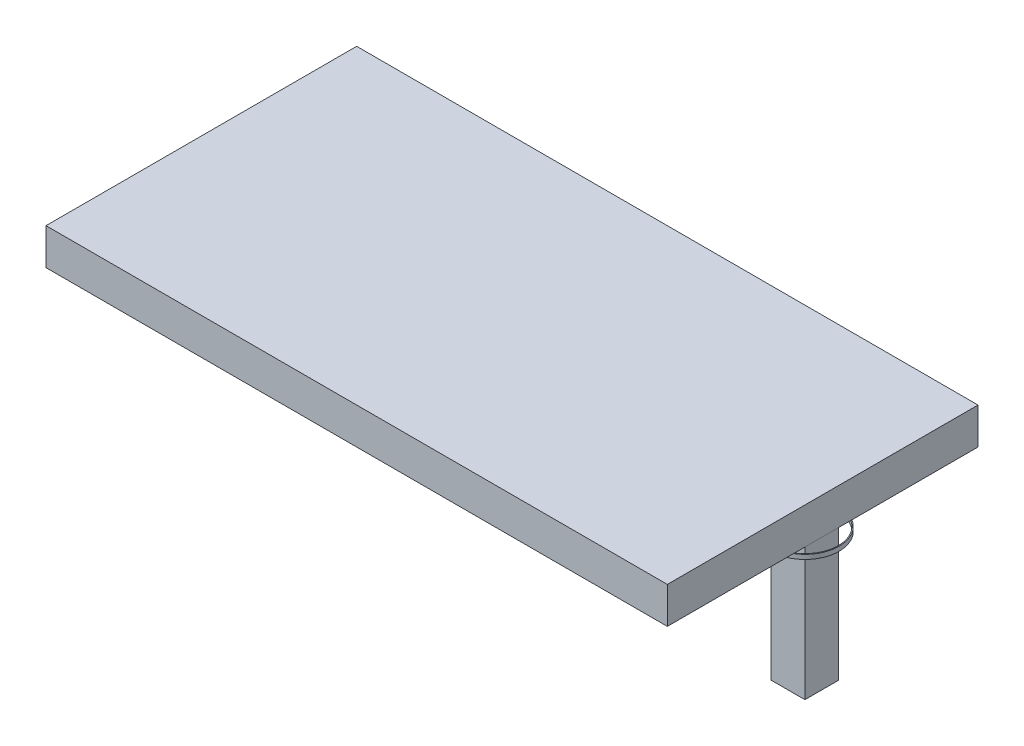
ISO-10303-21;
HEADER;
FILE_DESCRIPTION(('STEP AP214'),'2;1');
FILE_NAME('part.step','',(''),(''),'','','');
FILE_SCHEMA(('AUTOMOTIVE_DESIGN { 1 0 10303 214 1 1 1 1 }'));
ENDSEC;
DATA;
#1=APPLICATION_CONTEXT('core data for automotive mechanical design processes');
#2=APPLICATION_PROTOCOL_DEFINITION('international standard','automotive_design',2000,#1);
#3=PRODUCT_CONTEXT('',#1,'mechanical');
#4=PRODUCT('Part','Part','',(#3));
#5=PRODUCT_RELATED_PRODUCT_CATEGORY('part','',(#4));
#6=PRODUCT_DEFINITION_FORMATION('','',#4);
#7=PRODUCT_DEFINITION_CONTEXT('part definition',#1,'design');
#8=PRODUCT_DEFINITION('design','',#6,#7);
#9=PRODUCT_DEFINITION_SHAPE('','',#8);
#10=(LENGTH_UNIT() NAMED_UNIT(*) SI_UNIT(.MILLI.,.METRE.));
#11=(NAMED_UNIT(*) PLANE_ANGLE_UNIT() SI_UNIT($,.RADIAN.));
#12=(NAMED_UNIT(*) SI_UNIT($,.STERADIAN.) SOLID_ANGLE_UNIT());
#13=UNCERTAINTY_MEASURE_WITH_UNIT(LENGTH_MEASURE(1.E-05),#10,'distance_accuracy_value','');
#14=(GEOMETRIC_REPRESENTATION_CONTEXT(3) GLOBAL_UNCERTAINTY_ASSIGNED_CONTEXT((#13)) GLOBAL_UNIT_ASSIGNED_CONTEXT((#10,
#11,#12)) REPRESENTATION_CONTEXT('',''));
#15=CARTESIAN_POINT('',(0.,0.,0.));
#16=DIRECTION('',(0.,0.,1.));
#17=DIRECTION('',(1.,0.,0.));
#18=AXIS2_PLACEMENT_3D('',#15,#16,#17);
#19=CARTESIAN_POINT('',(0.,0.,0.));
#20=DIRECTION('',(0.,1.,0.));
#21=DIRECTION('',(0.,0.,1.));
#22=AXIS2_PLACEMENT_3D('',#19,#20,#21);
#23=PLANE('',#22);
#24=CARTESIAN_POINT('',(330.,0.,-1.11022302462516E-13));
#25=DIRECTION('',(0.,-1.,0.));
#26=DIRECTION('',(0.,0.,1.));
#27=AXIS2_PLACEMENT_3D('',#24,#25,#26);
#28=CIRCLE('',#27,38.5);
#29=CARTESIAN_POINT('',(310.,0.,-32.8975682991921));
#30=VERTEX_POINT('',#29);
#31=CARTESIAN_POINT('',(350.,0.,-32.897568299192));
#32=VERTEX_POINT('',#31);
#33=EDGE_CURVE('E244',#30,#32,#28,.T.);
#34=ORIENTED_EDGE('',*,*,#33,.F.);
#35=DIRECTION('',(0.,0.,-1.));
#36=VECTOR('',#35,1.);
#37=CARTESIAN_POINT('',(310.,0.,135.));
#38=LINE('',#37,#36);
#39=CARTESIAN_POINT('',(310.,0.,-135.));
#40=VERTEX_POINT('',#39);
#41=EDGE_CURVE('E230',#30,#40,#38,.T.);
#42=ORIENTED_EDGE('',*,*,#41,.T.);
#43=DIRECTION('',(-1.,0.,0.));
#44=VECTOR('',#43,1.);
#45=CARTESIAN_POINT('',(-310.,0.,-135.));
#46=LINE('',#45,#44);
#47=CARTESIAN_POINT('',(-310.,0.,-135.));
#48=VERTEX_POINT('',#47);
#49=EDGE_CURVE('E486',#40,#48,#46,.T.);
#50=ORIENTED_EDGE('',*,*,#49,.T.);
#51=DIRECTION('',(0.,0.,1.));
#52=VECTOR('',#51,1.);
#53=CARTESIAN_POINT('',(-310.,0.,135.));
#54=LINE('',#53,#52);
#55=CARTESIAN_POINT('',(-310.,0.,-32.897568299192));
#56=VERTEX_POINT('',#55);
#57=EDGE_CURVE('E490',#48,#56,#54,.T.);
#58=ORIENTED_EDGE('',*,*,#57,.T.);
#59=CARTESIAN_POINT('',(-330.,0.,0.));
#60=DIRECTION('',(0.,-1.,0.));
#61=DIRECTION('',(0.,0.,-1.));
#62=AXIS2_PLACEMENT_3D('',#59,#60,#61);
#63=CIRCLE('',#62,38.5);
#64=CARTESIAN_POINT('',(-350.,0.,-32.8975682991919));
#65=VERTEX_POINT('',#64);
#66=EDGE_CURVE('E366',#65,#56,#63,.T.);
#67=ORIENTED_EDGE('',*,*,#66,.F.);
#68=DIRECTION('',(0.,0.,1.));
#69=VECTOR('',#68,1.);
#70=CARTESIAN_POINT('',(-350.,0.,-175.));
#71=LINE('',#70,#69);
#72=CARTESIAN_POINT('',(-350.,0.,-175.));
#73=VERTEX_POINT('',#72);
#74=EDGE_CURVE('E333',#73,#65,#71,.T.);
#75=ORIENTED_EDGE('',*,*,#74,.F.);
#76=DIRECTION('',(-1.,0.,0.));
#77=VECTOR('',#76,1.);
#78=CARTESIAN_POINT('',(-350.,0.,-175.));
#79=LINE('',#78,#77);
#80=CARTESIAN_POINT('',(350.,0.,-175.));
#81=VERTEX_POINT('',#80);
#82=EDGE_CURVE('E507',#81,#73,#79,.T.);
#83=ORIENTED_EDGE('',*,*,#82,.F.);
#84=DIRECTION('',(0.,0.,-1.));
#85=VECTOR('',#84,1.);
#86=CARTESIAN_POINT('',(350.,0.,-175.));
#87=LINE('',#86,#85);
#88=EDGE_CURVE('E59',#32,#81,#87,.T.);
#89=ORIENTED_EDGE('',*,*,#88,.F.);
#90=EDGE_LOOP('',(#34,#42,#50,#58,#67,#75,#83,#89));
#91=FACE_BOUND('',#90,.T.);
#92=ADVANCED_FACE('F44',(#91),#23,.F.);
#93=CARTESIAN_POINT('',(350.,0.,32.8975682991918));
#94=VERTEX_POINT('',#93);
#95=CARTESIAN_POINT('',(310.,0.,32.8975682991919));
#96=VERTEX_POINT('',#95);
#97=EDGE_CURVE('E261',#94,#96,#28,.T.);
#98=ORIENTED_EDGE('',*,*,#97,.F.);
#99=CARTESIAN_POINT('',(350.,0.,175.));
#100=VERTEX_POINT('',#99);
#101=EDGE_CURVE('E504',#100,#94,#87,.T.);
#102=ORIENTED_EDGE('',*,*,#101,.F.);
#103=DIRECTION('',(1.,0.,0.));
#104=VECTOR('',#103,1.);
#105=CARTESIAN_POINT('',(-350.,0.,175.));
#106=LINE('',#105,#104);
#107=CARTESIAN_POINT('',(-350.,0.,175.));
#108=VERTEX_POINT('',#107);
#109=EDGE_CURVE('E510',#108,#100,#106,.T.);
#110=ORIENTED_EDGE('',*,*,#109,.F.);
#111=CARTESIAN_POINT('',(-350.,0.,32.8975682991919));
#112=VERTEX_POINT('',#111);
#113=EDGE_CURVE('E334',#112,#108,#71,.T.);
#114=ORIENTED_EDGE('',*,*,#113,.F.);
#115=CARTESIAN_POINT('',(-310.,0.,32.897568299192));
#116=VERTEX_POINT('',#115);
#117=EDGE_CURVE('E365',#116,#112,#63,.T.);
#118=ORIENTED_EDGE('',*,*,#117,.F.);
#119=CARTESIAN_POINT('',(-310.,0.,135.));
#120=VERTEX_POINT('',#119);
#121=EDGE_CURVE('E489',#116,#120,#54,.T.);
#122=ORIENTED_EDGE('',*,*,#121,.T.);
#123=DIRECTION('',(1.,0.,0.));
#124=VECTOR('',#123,1.);
#125=CARTESIAN_POINT('',(-310.,0.,135.));
#126=LINE('',#125,#124);
#127=CARTESIAN_POINT('',(-51.,0.,135.));
#128=VERTEX_POINT('',#127);
#129=EDGE_CURVE('E475',#120,#128,#126,.T.);
#130=ORIENTED_EDGE('',*,*,#129,.T.);
#131=DIRECTION('',(0.,0.,-1.));
#132=VECTOR('',#131,1.);
#133=CARTESIAN_POINT('',(-51.,0.,154.));
#134=LINE('',#133,#132);
#135=CARTESIAN_POINT('',(-51.,0.,154.));
#136=VERTEX_POINT('',#135);
#137=EDGE_CURVE('E379',#136,#128,#134,.T.);
#138=ORIENTED_EDGE('',*,*,#137,.F.);
#139=DIRECTION('',(-1.,0.,0.));
#140=VECTOR('',#139,1.);
#141=CARTESIAN_POINT('',(-51.,0.,154.));
#142=LINE('',#141,#140);
#143=CARTESIAN_POINT('',(-32.,0.,154.));
#144=VERTEX_POINT('',#143);
#145=EDGE_CURVE('E372',#144,#136,#142,.T.);
#146=ORIENTED_EDGE('',*,*,#145,.F.);
#147=DIRECTION('',(0.,0.,1.));
#148=VECTOR('',#147,1.);
#149=CARTESIAN_POINT('',(-32.,0.,154.));
#150=LINE('',#149,#148);
#151=CARTESIAN_POINT('',(-32.,0.,135.));
#152=VERTEX_POINT('',#151);
#153=EDGE_CURVE('E382',#152,#144,#150,.T.);
#154=ORIENTED_EDGE('',*,*,#153,.F.);
#155=CARTESIAN_POINT('',(310.,0.,135.));
#156=VERTEX_POINT('',#155);
#157=EDGE_CURVE('E493',#152,#156,#126,.T.);
#158=ORIENTED_EDGE('',*,*,#157,.T.);
#159=EDGE_CURVE('E242',#156,#96,#38,.T.);
#160=ORIENTED_EDGE('',*,*,#159,.T.);
#161=EDGE_LOOP('',(#98,#102,#110,#114,#118,#122,#130,#138,#146,#154,#158,#160));
#162=FACE_BOUND('',#161,.T.);
#163=ADVANCED_FACE('F297',(#162),#23,.F.);
#164=DIRECTION('',(-1.,0.,0.));
#165=VECTOR('',#164,1.);
#166=CARTESIAN_POINT('',(349.,0.,18.9999999999999));
#167=LINE('',#166,#165);
#168=CARTESIAN_POINT('',(349.,0.,18.9999999999999));
#169=VERTEX_POINT('',#168);
#170=CARTESIAN_POINT('',(311.,0.,18.9999999999999));
#171=VERTEX_POINT('',#170);
#172=EDGE_CURVE('E398',#169,#171,#167,.T.);
#173=ORIENTED_EDGE('',*,*,#172,.F.);
#174=DIRECTION('',(0.,0.,1.));
#175=VECTOR('',#174,1.);
#176=CARTESIAN_POINT('',(349.,0.,18.9999999999999));
#177=LINE('',#176,#175);
#178=CARTESIAN_POINT('',(349.,0.,-19.0000000000001));
#179=VERTEX_POINT('',#178);
#180=EDGE_CURVE('E403',#179,#169,#177,.T.);
#181=ORIENTED_EDGE('',*,*,#180,.F.);
#182=DIRECTION('',(1.,0.,0.));
#183=VECTOR('',#182,1.);
#184=CARTESIAN_POINT('',(349.,0.,-19.0000000000001));
#185=LINE('',#184,#183);
#186=CARTESIAN_POINT('',(311.,0.,-19.0000000000001));
#187=VERTEX_POINT('',#186);
#188=EDGE_CURVE('E415',#187,#179,#185,.T.);
#189=ORIENTED_EDGE('',*,*,#188,.F.);
#190=DIRECTION('',(0.,0.,-1.));
#191=VECTOR('',#190,1.);
#192=CARTESIAN_POINT('',(311.,0.,18.9999999999999));
#193=LINE('',#192,#191);
#194=EDGE_CURVE('E412',#171,#187,#193,.T.);
#195=ORIENTED_EDGE('',*,*,#194,.F.);
#196=EDGE_LOOP('',(#173,#181,#189,#195));
#197=FACE_BOUND('',#196,.T.);
#198=CARTESIAN_POINT('',(310.,0.,31.7214438511236));
#199=VERTEX_POINT('',#198);
#200=CARTESIAN_POINT('',(310.,0.,-31.7214438511239));
#201=VERTEX_POINT('',#200);
#202=EDGE_CURVE('E258',#199,#201,#38,.T.);
#203=ORIENTED_EDGE('',*,*,#202,.T.);
#204=CARTESIAN_POINT('',(330.,0.,-1.11022302462516E-13));
#205=DIRECTION('',(0.,-1.,0.));
#206=DIRECTION('',(0.,0.,1.));
#207=AXIS2_PLACEMENT_3D('',#204,#205,#206);
#208=CIRCLE('',#207,37.4999999999999);
#209=CARTESIAN_POINT('',(350.,0.,-31.7214438511237));
#210=VERTEX_POINT('',#209);
#211=EDGE_CURVE('E67',#201,#210,#208,.T.);
#212=ORIENTED_EDGE('',*,*,#211,.T.);
#213=CARTESIAN_POINT('',(350.,0.,31.7214438511235));
#214=VERTEX_POINT('',#213);
#215=EDGE_CURVE('E508',#214,#210,#87,.T.);
#216=ORIENTED_EDGE('',*,*,#215,.F.);
#217=EDGE_CURVE('E273',#214,#199,#208,.T.);
#218=ORIENTED_EDGE('',*,*,#217,.T.);
#219=EDGE_LOOP('',(#203,#212,#216,#218));
#220=FACE_BOUND('',#219,.T.);
#221=ADVANCED_FACE('F303',(#197,#220),#23,.F.);
#222=DIRECTION('',(0.,0.,-1.));
#223=VECTOR('',#222,1.);
#224=CARTESIAN_POINT('',(-349.,0.,19.));
#225=LINE('',#224,#223);
#226=CARTESIAN_POINT('',(-349.,0.,19.));
#227=VERTEX_POINT('',#226);
#228=CARTESIAN_POINT('',(-349.,0.,-19.));
#229=VERTEX_POINT('',#228);
#230=EDGE_CURVE('E318',#227,#229,#225,.T.);
#231=ORIENTED_EDGE('',*,*,#230,.F.);
#232=DIRECTION('',(-1.,0.,0.));
#233=VECTOR('',#232,1.);
#234=CARTESIAN_POINT('',(-349.,0.,19.));
#235=LINE('',#234,#233);
#236=CARTESIAN_POINT('',(-311.,0.,19.));
#237=VERTEX_POINT('',#236);
#238=EDGE_CURVE('E435',#237,#227,#235,.T.);
#239=ORIENTED_EDGE('',*,*,#238,.F.);
#240=DIRECTION('',(0.,0.,1.));
#241=VECTOR('',#240,1.);
#242=CARTESIAN_POINT('',(-311.,0.,19.));
#243=LINE('',#242,#241);
#244=CARTESIAN_POINT('',(-311.,0.,-19.));
#245=VERTEX_POINT('',#244);
#246=EDGE_CURVE('E446',#245,#237,#243,.T.);
#247=ORIENTED_EDGE('',*,*,#246,.F.);
#248=DIRECTION('',(1.,0.,0.));
#249=VECTOR('',#248,1.);
#250=CARTESIAN_POINT('',(-349.,0.,-19.));
#251=LINE('',#250,#249);
#252=EDGE_CURVE('E443',#229,#245,#251,.T.);
#253=ORIENTED_EDGE('',*,*,#252,.F.);
#254=EDGE_LOOP('',(#231,#239,#247,#253));
#255=FACE_BOUND('',#254,.T.);
#256=CARTESIAN_POINT('',(-350.,0.,-31.7214438511239));
#257=VERTEX_POINT('',#256);
#258=CARTESIAN_POINT('',(-350.,0.,31.7214438511239));
#259=VERTEX_POINT('',#258);
#260=EDGE_CURVE('E322',#257,#259,#71,.T.);
#261=ORIENTED_EDGE('',*,*,#260,.F.);
#262=CARTESIAN_POINT('',(-330.,0.,0.));
#263=DIRECTION('',(0.,-1.,0.));
#264=DIRECTION('',(0.,0.,-1.));
#265=AXIS2_PLACEMENT_3D('',#262,#263,#264);
#266=CIRCLE('',#265,37.5);
#267=CARTESIAN_POINT('',(-310.,0.,-31.7214438511239));
#268=VERTEX_POINT('',#267);
#269=EDGE_CURVE('E326',#257,#268,#266,.T.);
#270=ORIENTED_EDGE('',*,*,#269,.T.);
#271=CARTESIAN_POINT('',(-310.,0.,31.7214438511239));
#272=VERTEX_POINT('',#271);
#273=EDGE_CURVE('E644',#268,#272,#54,.T.);
#274=ORIENTED_EDGE('',*,*,#273,.T.);
#275=EDGE_CURVE('E329',#272,#259,#266,.T.);
#276=ORIENTED_EDGE('',*,*,#275,.T.);
#277=EDGE_LOOP('',(#261,#270,#274,#276));
#278=FACE_BOUND('',#277,.T.);
#279=ADVANCED_FACE('F299',(#255,#278),#23,.F.);
#280=CARTESIAN_POINT('',(350.,40.,-175.));
#281=DIRECTION('',(-1.,0.,0.));
#282=DIRECTION('',(0.,0.,1.));
#283=AXIS2_PLACEMENT_3D('',#280,#281,#282);
#284=PLANE('',#283);
#285=ORIENTED_EDGE('',*,*,#101,.T.);
#286=DIRECTION('',(0.,0.,-1.));
#287=VECTOR('',#286,1.);
#288=CARTESIAN_POINT('',(350.,0.,-175.));
#289=LINE('',#288,#287);
#290=EDGE_CURVE('E285',#94,#214,#289,.T.);
#291=ORIENTED_EDGE('',*,*,#290,.T.);
#292=ORIENTED_EDGE('',*,*,#215,.T.);
#293=EDGE_CURVE('E264',#210,#32,#289,.T.);
#294=ORIENTED_EDGE('',*,*,#293,.T.);
#295=ORIENTED_EDGE('',*,*,#88,.T.);
#296=DIRECTION('',(0.,-1.,0.));
#297=VECTOR('',#296,1.);
#298=CARTESIAN_POINT('',(350.,40.,-175.));
#299=LINE('',#298,#297);
#300=CARTESIAN_POINT('',(350.,41.,-175.));
#301=VERTEX_POINT('',#300);
#302=EDGE_CURVE('E13',#301,#81,#299,.T.);
#303=ORIENTED_EDGE('',*,*,#302,.F.);
#304=DIRECTION('',(0.,0.,-1.));
#305=VECTOR('',#304,1.);
#306=CARTESIAN_POINT('',(350.,41.,175.));
#307=LINE('',#306,#305);
#308=CARTESIAN_POINT('',(350.,41.,175.));
#309=VERTEX_POINT('',#308);
#310=EDGE_CURVE('E464',#309,#301,#307,.T.);
#311=ORIENTED_EDGE('',*,*,#310,.F.);
#312=DIRECTION('',(0.,-1.,0.));
#313=VECTOR('',#312,1.);
#314=CARTESIAN_POINT('',(350.,40.,175.));
#315=LINE('',#314,#313);
#316=EDGE_CURVE('E512',#309,#100,#315,.T.);
#317=ORIENTED_EDGE('',*,*,#316,.T.);
#318=EDGE_LOOP('',(#285,#291,#292,#294,#295,#303,#311,#317));
#319=FACE_BOUND('',#318,.T.);
#320=ADVANCED_FACE('F46',(#319),#284,.F.);
#321=CARTESIAN_POINT('',(-350.,40.,-175.));
#322=DIRECTION('',(0.,0.,1.));
#323=DIRECTION('',(1.,0.,0.));
#324=AXIS2_PLACEMENT_3D('',#321,#322,#323);
#325=PLANE('',#324);
#326=ORIENTED_EDGE('',*,*,#82,.T.);
#327=DIRECTION('',(0.,-1.,0.));
#328=VECTOR('',#327,1.);
#329=CARTESIAN_POINT('',(-350.,40.,-175.));
#330=LINE('',#329,#328);
#331=CARTESIAN_POINT('',(-350.,41.,-175.));
#332=VERTEX_POINT('',#331);
#333=EDGE_CURVE('E52',#332,#73,#330,.T.);
#334=ORIENTED_EDGE('',*,*,#333,.F.);
#335=DIRECTION('',(-1.,0.,0.));
#336=VECTOR('',#335,1.);
#337=CARTESIAN_POINT('',(350.,41.,-175.));
#338=LINE('',#337,#336);
#339=EDGE_CURVE('E467',#301,#332,#338,.T.);
#340=ORIENTED_EDGE('',*,*,#339,.F.);
#341=ORIENTED_EDGE('',*,*,#302,.T.);
#342=EDGE_LOOP('',(#326,#334,#340,#341));
#343=FACE_BOUND('',#342,.T.);
#344=ADVANCED_FACE('F313',(#343),#325,.F.);
#345=CARTESIAN_POINT('',(-350.,40.,-175.));
#346=DIRECTION('',(1.,0.,0.));
#347=DIRECTION('',(0.,0.,-1.));
#348=AXIS2_PLACEMENT_3D('',#345,#346,#347);
#349=PLANE('',#348);
#350=ORIENTED_EDGE('',*,*,#74,.T.);
#351=DIRECTION('',(0.,0.,-1.));
#352=VECTOR('',#351,1.);
#353=CARTESIAN_POINT('',(-350.,0.,-175.));
#354=LINE('',#353,#352);
#355=EDGE_CURVE('E338',#257,#65,#354,.T.);
#356=ORIENTED_EDGE('',*,*,#355,.F.);
#357=ORIENTED_EDGE('',*,*,#260,.T.);
#358=EDGE_CURVE('E346',#112,#259,#354,.T.);
#359=ORIENTED_EDGE('',*,*,#358,.F.);
#360=ORIENTED_EDGE('',*,*,#113,.T.);
#361=DIRECTION('',(0.,-1.,0.));
#362=VECTOR('',#361,1.);
#363=CARTESIAN_POINT('',(-350.,40.,175.));
#364=LINE('',#363,#362);
#365=CARTESIAN_POINT('',(-350.,41.,175.));
#366=VERTEX_POINT('',#365);
#367=EDGE_CURVE('E515',#366,#108,#364,.T.);
#368=ORIENTED_EDGE('',*,*,#367,.F.);
#369=DIRECTION('',(0.,0.,1.));
#370=VECTOR('',#369,1.);
#371=CARTESIAN_POINT('',(-350.,41.,-175.));
#372=LINE('',#371,#370);
#373=EDGE_CURVE('E240',#332,#366,#372,.T.);
#374=ORIENTED_EDGE('',*,*,#373,.F.);
#375=ORIENTED_EDGE('',*,*,#333,.T.);
#376=EDGE_LOOP('',(#350,#356,#357,#359,#360,#368,#374,#375));
#377=FACE_BOUND('',#376,.T.);
#378=ADVANCED_FACE('F339',(#377),#349,.F.);
#379=CARTESIAN_POINT('',(-350.,40.,175.));
#380=DIRECTION('',(0.,0.,-1.));
#381=DIRECTION('',(-1.,0.,0.));
#382=AXIS2_PLACEMENT_3D('',#379,#380,#381);
#383=PLANE('',#382);
#384=ORIENTED_EDGE('',*,*,#109,.T.);
#385=ORIENTED_EDGE('',*,*,#316,.F.);
#386=DIRECTION('',(1.,0.,0.));
#387=VECTOR('',#386,1.);
#388=CARTESIAN_POINT('',(-350.,41.,175.));
#389=LINE('',#388,#387);
#390=EDGE_CURVE('E461',#366,#309,#389,.T.);
#391=ORIENTED_EDGE('',*,*,#390,.F.);
#392=ORIENTED_EDGE('',*,*,#367,.T.);
#393=EDGE_LOOP('',(#384,#385,#391,#392));
#394=FACE_BOUND('',#393,.T.);
#395=ADVANCED_FACE('F622',(#394),#383,.F.);
#396=CARTESIAN_POINT('',(310.,40.,135.));
#397=DIRECTION('',(-1.,0.,0.));
#398=DIRECTION('',(0.,0.,1.));
#399=AXIS2_PLACEMENT_3D('',#396,#397,#398);
#400=PLANE('',#399);
#401=ORIENTED_EDGE('',*,*,#159,.F.);
#402=DIRECTION('',(0.,-1.,0.));
#403=VECTOR('',#402,1.);
#404=CARTESIAN_POINT('',(310.,40.,135.));
#405=LINE('',#404,#403);
#406=CARTESIAN_POINT('',(310.,40.,135.));
#407=VERTEX_POINT('',#406);
#408=EDGE_CURVE('E483',#407,#156,#405,.T.);
#409=ORIENTED_EDGE('',*,*,#408,.F.);
#410=DIRECTION('',(0.,0.,-1.));
#411=VECTOR('',#410,1.);
#412=CARTESIAN_POINT('',(310.,40.,135.));
#413=LINE('',#412,#411);
#414=CARTESIAN_POINT('',(310.,40.,-135.));
#415=VERTEX_POINT('',#414);
#416=EDGE_CURVE('E472',#407,#415,#413,.T.);
#417=ORIENTED_EDGE('',*,*,#416,.T.);
#418=DIRECTION('',(0.,-1.,0.));
#419=VECTOR('',#418,1.);
#420=CARTESIAN_POINT('',(310.,40.,-135.));
#421=LINE('',#420,#419);
#422=EDGE_CURVE('E237',#415,#40,#421,.T.);
#423=ORIENTED_EDGE('',*,*,#422,.T.);
#424=ORIENTED_EDGE('',*,*,#41,.F.);
#425=EDGE_CURVE('E234',#201,#30,#38,.T.);
#426=ORIENTED_EDGE('',*,*,#425,.F.);
#427=ORIENTED_EDGE('',*,*,#202,.F.);
#428=EDGE_CURVE('E487',#96,#199,#38,.T.);
#429=ORIENTED_EDGE('',*,*,#428,.F.);
#430=EDGE_LOOP('',(#401,#409,#417,#423,#424,#426,#427,#429));
#431=FACE_BOUND('',#430,.T.);
#432=ADVANCED_FACE('F232',(#431),#400,.T.);
#433=CARTESIAN_POINT('',(-310.,40.,-135.));
#434=DIRECTION('',(0.,0.,1.));
#435=DIRECTION('',(1.,0.,0.));
#436=AXIS2_PLACEMENT_3D('',#433,#434,#435);
#437=PLANE('',#436);
#438=ORIENTED_EDGE('',*,*,#49,.F.);
#439=ORIENTED_EDGE('',*,*,#422,.F.);
#440=DIRECTION('',(-1.,0.,0.));
#441=VECTOR('',#440,1.);
#442=CARTESIAN_POINT('',(-310.,40.,-135.));
#443=LINE('',#442,#441);
#444=CARTESIAN_POINT('',(-310.,40.,-135.));
#445=VERTEX_POINT('',#444);
#446=EDGE_CURVE('E474',#415,#445,#443,.T.);
#447=ORIENTED_EDGE('',*,*,#446,.T.);
#448=DIRECTION('',(0.,-1.,0.));
#449=VECTOR('',#448,1.);
#450=CARTESIAN_POINT('',(-310.,40.,-135.));
#451=LINE('',#450,#449);
#452=EDGE_CURVE('E501',#445,#48,#451,.T.);
#453=ORIENTED_EDGE('',*,*,#452,.T.);
#454=EDGE_LOOP('',(#438,#439,#447,#453));
#455=FACE_BOUND('',#454,.T.);
#456=ADVANCED_FACE('F617',(#455),#437,.T.);
#457=CARTESIAN_POINT('',(-310.,40.,135.));
#458=DIRECTION('',(1.,0.,0.));
#459=DIRECTION('',(0.,0.,-1.));
#460=AXIS2_PLACEMENT_3D('',#457,#458,#459);
#461=PLANE('',#460);
#462=ORIENTED_EDGE('',*,*,#57,.F.);
#463=ORIENTED_EDGE('',*,*,#452,.F.);
#464=DIRECTION('',(0.,0.,1.));
#465=VECTOR('',#464,1.);
#466=CARTESIAN_POINT('',(-310.,40.,135.));
#467=LINE('',#466,#465);
#468=CARTESIAN_POINT('',(-310.,40.,135.));
#469=VERTEX_POINT('',#468);
#470=EDGE_CURVE('E478',#445,#469,#467,.T.);
#471=ORIENTED_EDGE('',*,*,#470,.T.);
#472=DIRECTION('',(0.,-1.,0.));
#473=VECTOR('',#472,1.);
#474=CARTESIAN_POINT('',(-310.,40.,135.));
#475=LINE('',#474,#473);
#476=EDGE_CURVE('E498',#469,#120,#475,.T.);
#477=ORIENTED_EDGE('',*,*,#476,.T.);
#478=ORIENTED_EDGE('',*,*,#121,.F.);
#479=EDGE_CURVE('E645',#272,#116,#54,.T.);
#480=ORIENTED_EDGE('',*,*,#479,.F.);
#481=ORIENTED_EDGE('',*,*,#273,.F.);
#482=EDGE_CURVE('E494',#56,#268,#54,.T.);
#483=ORIENTED_EDGE('',*,*,#482,.F.);
#484=EDGE_LOOP('',(#462,#463,#471,#477,#478,#480,#481,#483));
#485=FACE_BOUND('',#484,.T.);
#486=ADVANCED_FACE('F613',(#485),#461,.T.);
#487=CARTESIAN_POINT('',(-310.,40.,135.));
#488=DIRECTION('',(0.,0.,-1.));
#489=DIRECTION('',(-1.,0.,0.));
#490=AXIS2_PLACEMENT_3D('',#487,#488,#489);
#491=PLANE('',#490);
#492=ORIENTED_EDGE('',*,*,#129,.F.);
#493=ORIENTED_EDGE('',*,*,#476,.F.);
#494=DIRECTION('',(1.,0.,0.));
#495=VECTOR('',#494,1.);
#496=CARTESIAN_POINT('',(-310.,40.,135.));
#497=LINE('',#496,#495);
#498=EDGE_CURVE('E481',#469,#407,#497,.T.);
#499=ORIENTED_EDGE('',*,*,#498,.T.);
#500=ORIENTED_EDGE('',*,*,#408,.T.);
#501=ORIENTED_EDGE('',*,*,#157,.F.);
#502=DIRECTION('',(0.,1.,0.));
#503=VECTOR('',#502,1.);
#504=CARTESIAN_POINT('',(-32.,-20.,135.));
#505=LINE('',#504,#503);
#506=CARTESIAN_POINT('',(-32.,-20.,135.));
#507=VERTEX_POINT('',#506);
#508=EDGE_CURVE('E392',#507,#152,#505,.T.);
#509=ORIENTED_EDGE('',*,*,#508,.F.);
#510=DIRECTION('',(1.,0.,0.));
#511=VECTOR('',#510,1.);
#512=CARTESIAN_POINT('',(-51.,-20.,135.));
#513=LINE('',#512,#511);
#514=CARTESIAN_POINT('',(-51.,-20.,135.));
#515=VERTEX_POINT('',#514);
#516=EDGE_CURVE('E371',#515,#507,#513,.T.);
#517=ORIENTED_EDGE('',*,*,#516,.F.);
#518=DIRECTION('',(0.,1.,0.));
#519=VECTOR('',#518,1.);
#520=CARTESIAN_POINT('',(-51.,-20.,135.));
#521=LINE('',#520,#519);
#522=EDGE_CURVE('E395',#515,#128,#521,.T.);
#523=ORIENTED_EDGE('',*,*,#522,.T.);
#524=EDGE_LOOP('',(#492,#493,#499,#500,#501,#509,#517,#523));
#525=FACE_BOUND('',#524,.T.);
#526=ADVANCED_FACE('F609',(#525),#491,.T.);
#527=CARTESIAN_POINT('',(0.,40.,0.));
#528=DIRECTION('',(0.,1.,0.));
#529=DIRECTION('',(0.,0.,1.));
#530=AXIS2_PLACEMENT_3D('',#527,#528,#529);
#531=PLANE('',#530);
#532=ORIENTED_EDGE('',*,*,#416,.F.);
#533=ORIENTED_EDGE('',*,*,#498,.F.);
#534=ORIENTED_EDGE('',*,*,#470,.F.);
#535=ORIENTED_EDGE('',*,*,#446,.F.);
#536=EDGE_LOOP('',(#532,#533,#534,#535));
#537=FACE_BOUND('',#536,.T.);
#538=ADVANCED_FACE('F605',(#537),#531,.F.);
#539=CARTESIAN_POINT('',(0.,41.,0.));
#540=DIRECTION('',(0.,1.,0.));
#541=DIRECTION('',(0.,0.,1.));
#542=AXIS2_PLACEMENT_3D('',#539,#540,#541);
#543=PLANE('',#542);
#544=ORIENTED_EDGE('',*,*,#390,.T.);
#545=ORIENTED_EDGE('',*,*,#310,.T.);
#546=ORIENTED_EDGE('',*,*,#339,.T.);
#547=ORIENTED_EDGE('',*,*,#373,.T.);
#548=EDGE_LOOP('',(#544,#545,#546,#547));
#549=FACE_BOUND('',#548,.T.);
#550=ADVANCED_FACE('F601',(#549),#543,.T.);
#551=CARTESIAN_POINT('',(-349.,-150.,19.));
#552=DIRECTION('',(1.,0.,0.));
#553=DIRECTION('',(0.,0.,-1.));
#554=AXIS2_PLACEMENT_3D('',#551,#552,#553);
#555=PLANE('',#554);
#556=ORIENTED_EDGE('',*,*,#230,.T.);
#557=DIRECTION('',(0.,1.,0.));
#558=VECTOR('',#557,1.);
#559=CARTESIAN_POINT('',(-349.,-150.,-19.));
#560=LINE('',#559,#558);
#561=CARTESIAN_POINT('',(-349.,-150.,-19.));
#562=VERTEX_POINT('',#561);
#563=EDGE_CURVE('E458',#562,#229,#560,.T.);
#564=ORIENTED_EDGE('',*,*,#563,.F.);
#565=DIRECTION('',(0.,0.,-1.));
#566=VECTOR('',#565,1.);
#567=CARTESIAN_POINT('',(-349.,-150.,19.));
#568=LINE('',#567,#566);
#569=CARTESIAN_POINT('',(-349.,-150.,19.));
#570=VERTEX_POINT('',#569);
#571=EDGE_CURVE('E431',#570,#562,#568,.T.);
#572=ORIENTED_EDGE('',*,*,#571,.F.);
#573=DIRECTION('',(0.,1.,0.));
#574=VECTOR('',#573,1.);
#575=CARTESIAN_POINT('',(-349.,-150.,19.));
#576=LINE('',#575,#574);
#577=EDGE_CURVE('E441',#570,#227,#576,.T.);
#578=ORIENTED_EDGE('',*,*,#577,.T.);
#579=EDGE_LOOP('',(#556,#564,#572,#578));
#580=FACE_BOUND('',#579,.T.);
#581=ADVANCED_FACE('F597',(#580),#555,.F.);
#582=CARTESIAN_POINT('',(-349.,-150.,-19.));
#583=DIRECTION('',(0.,0.,1.));
#584=DIRECTION('',(1.,0.,0.));
#585=AXIS2_PLACEMENT_3D('',#582,#583,#584);
#586=PLANE('',#585);
#587=ORIENTED_EDGE('',*,*,#252,.T.);
#588=DIRECTION('',(0.,1.,0.));
#589=VECTOR('',#588,1.);
#590=CARTESIAN_POINT('',(-311.,-150.,-19.));
#591=LINE('',#590,#589);
#592=CARTESIAN_POINT('',(-311.,-150.,-19.));
#593=VERTEX_POINT('',#592);
#594=EDGE_CURVE('E455',#593,#245,#591,.T.);
#595=ORIENTED_EDGE('',*,*,#594,.F.);
#596=DIRECTION('',(1.,0.,0.));
#597=VECTOR('',#596,1.);
#598=CARTESIAN_POINT('',(-349.,-150.,-19.));
#599=LINE('',#598,#597);
#600=EDGE_CURVE('E434',#562,#593,#599,.T.);
#601=ORIENTED_EDGE('',*,*,#600,.F.);
#602=ORIENTED_EDGE('',*,*,#563,.T.);
#603=EDGE_LOOP('',(#587,#595,#601,#602));
#604=FACE_BOUND('',#603,.T.);
#605=ADVANCED_FACE('F593',(#604),#586,.F.);
#606=CARTESIAN_POINT('',(-311.,-150.,19.));
#607=DIRECTION('',(-1.,0.,0.));
#608=DIRECTION('',(0.,0.,1.));
#609=AXIS2_PLACEMENT_3D('',#606,#607,#608);
#610=PLANE('',#609);
#611=ORIENTED_EDGE('',*,*,#246,.T.);
#612=DIRECTION('',(0.,1.,0.));
#613=VECTOR('',#612,1.);
#614=CARTESIAN_POINT('',(-311.,-150.,19.));
#615=LINE('',#614,#613);
#616=CARTESIAN_POINT('',(-311.,-150.,19.));
#617=VERTEX_POINT('',#616);
#618=EDGE_CURVE('E452',#617,#237,#615,.T.);
#619=ORIENTED_EDGE('',*,*,#618,.F.);
#620=DIRECTION('',(0.,0.,1.));
#621=VECTOR('',#620,1.);
#622=CARTESIAN_POINT('',(-311.,-150.,19.));
#623=LINE('',#622,#621);
#624=EDGE_CURVE('E437',#593,#617,#623,.T.);
#625=ORIENTED_EDGE('',*,*,#624,.F.);
#626=ORIENTED_EDGE('',*,*,#594,.T.);
#627=EDGE_LOOP('',(#611,#619,#625,#626));
#628=FACE_BOUND('',#627,.T.);
#629=ADVANCED_FACE('F589',(#628),#610,.F.);
#630=CARTESIAN_POINT('',(-349.,-150.,19.));
#631=DIRECTION('',(0.,0.,-1.));
#632=DIRECTION('',(-1.,0.,0.));
#633=AXIS2_PLACEMENT_3D('',#630,#631,#632);
#634=PLANE('',#633);
#635=ORIENTED_EDGE('',*,*,#238,.T.);
#636=ORIENTED_EDGE('',*,*,#577,.F.);
#637=DIRECTION('',(-1.,0.,0.));
#638=VECTOR('',#637,1.);
#639=CARTESIAN_POINT('',(-349.,-150.,19.));
#640=LINE('',#639,#638);
#641=EDGE_CURVE('E439',#617,#570,#640,.T.);
#642=ORIENTED_EDGE('',*,*,#641,.F.);
#643=ORIENTED_EDGE('',*,*,#618,.T.);
#644=EDGE_LOOP('',(#635,#636,#642,#643));
#645=FACE_BOUND('',#644,.T.);
#646=ADVANCED_FACE('F585',(#645),#634,.F.);
#647=CARTESIAN_POINT('',(0.,-150.,0.));
#648=DIRECTION('',(0.,-1.,0.));
#649=DIRECTION('',(0.,0.,-1.));
#650=AXIS2_PLACEMENT_3D('',#647,#648,#649);
#651=PLANE('',#650);
#652=ORIENTED_EDGE('',*,*,#571,.T.);
#653=ORIENTED_EDGE('',*,*,#600,.T.);
#654=ORIENTED_EDGE('',*,*,#624,.T.);
#655=ORIENTED_EDGE('',*,*,#641,.T.);
#656=EDGE_LOOP('',(#652,#653,#654,#655));
#657=FACE_BOUND('',#656,.T.);
#658=ADVANCED_FACE('F581',(#657),#651,.T.);
#659=CARTESIAN_POINT('',(349.,-150.,18.9999999999999));
#660=DIRECTION('',(0.,0.,-1.));
#661=DIRECTION('',(-1.,0.,0.));
#662=AXIS2_PLACEMENT_3D('',#659,#660,#661);
#663=PLANE('',#662);
#664=ORIENTED_EDGE('',*,*,#172,.T.);
#665=DIRECTION('',(0.,1.,0.));
#666=VECTOR('',#665,1.);
#667=CARTESIAN_POINT('',(311.,-150.,18.9999999999999));
#668=LINE('',#667,#666);
#669=CARTESIAN_POINT('',(311.,-150.,18.9999999999999));
#670=VERTEX_POINT('',#669);
#671=EDGE_CURVE('E428',#670,#171,#668,.T.);
#672=ORIENTED_EDGE('',*,*,#671,.F.);
#673=DIRECTION('',(-1.,0.,0.));
#674=VECTOR('',#673,1.);
#675=CARTESIAN_POINT('',(349.,-150.,18.9999999999999));
#676=LINE('',#675,#674);
#677=CARTESIAN_POINT('',(349.,-150.,18.9999999999999));
#678=VERTEX_POINT('',#677);
#679=EDGE_CURVE('E399',#678,#670,#676,.T.);
#680=ORIENTED_EDGE('',*,*,#679,.F.);
#681=DIRECTION('',(0.,1.,0.));
#682=VECTOR('',#681,1.);
#683=CARTESIAN_POINT('',(349.,-150.,18.9999999999999));
#684=LINE('',#683,#682);
#685=EDGE_CURVE('E409',#678,#169,#684,.T.);
#686=ORIENTED_EDGE('',*,*,#685,.T.);
#687=EDGE_LOOP('',(#664,#672,#680,#686));
#688=FACE_BOUND('',#687,.T.);
#689=ADVANCED_FACE('F577',(#688),#663,.F.);
#690=CARTESIAN_POINT('',(311.,-150.,18.9999999999999));
#691=DIRECTION('',(1.,0.,0.));
#692=DIRECTION('',(0.,0.,-1.));
#693=AXIS2_PLACEMENT_3D('',#690,#691,#692);
#694=PLANE('',#693);
#695=ORIENTED_EDGE('',*,*,#194,.T.);
#696=DIRECTION('',(0.,1.,0.));
#697=VECTOR('',#696,1.);
#698=CARTESIAN_POINT('',(311.,-150.,-19.0000000000001));
#699=LINE('',#698,#697);
#700=CARTESIAN_POINT('',(311.,-150.,-19.0000000000001));
#701=VERTEX_POINT('',#700);
#702=EDGE_CURVE('E425',#701,#187,#699,.T.);
#703=ORIENTED_EDGE('',*,*,#702,.F.);
#704=DIRECTION('',(0.,0.,-1.));
#705=VECTOR('',#704,1.);
#706=CARTESIAN_POINT('',(311.,-150.,18.9999999999999));
#707=LINE('',#706,#705);
#708=EDGE_CURVE('E402',#670,#701,#707,.T.);
#709=ORIENTED_EDGE('',*,*,#708,.F.);
#710=ORIENTED_EDGE('',*,*,#671,.T.);
#711=EDGE_LOOP('',(#695,#703,#709,#710));
#712=FACE_BOUND('',#711,.T.);
#713=ADVANCED_FACE('F573',(#712),#694,.F.);
#714=CARTESIAN_POINT('',(349.,-150.,-19.0000000000001));
#715=DIRECTION('',(0.,0.,1.));
#716=DIRECTION('',(1.,0.,0.));
#717=AXIS2_PLACEMENT_3D('',#714,#715,#716);
#718=PLANE('',#717);
#719=ORIENTED_EDGE('',*,*,#188,.T.);
#720=DIRECTION('',(0.,1.,0.));
#721=VECTOR('',#720,1.);
#722=CARTESIAN_POINT('',(349.,-150.,-19.0000000000001));
#723=LINE('',#722,#721);
#724=CARTESIAN_POINT('',(349.,-150.,-19.0000000000001));
#725=VERTEX_POINT('',#724);
#726=EDGE_CURVE('E422',#725,#179,#723,.T.);
#727=ORIENTED_EDGE('',*,*,#726,.F.);
#728=DIRECTION('',(1.,0.,0.));
#729=VECTOR('',#728,1.);
#730=CARTESIAN_POINT('',(349.,-150.,-19.0000000000001));
#731=LINE('',#730,#729);
#732=EDGE_CURVE('E405',#701,#725,#731,.T.);
#733=ORIENTED_EDGE('',*,*,#732,.F.);
#734=ORIENTED_EDGE('',*,*,#702,.T.);
#735=EDGE_LOOP('',(#719,#727,#733,#734));
#736=FACE_BOUND('',#735,.T.);
#737=ADVANCED_FACE('F569',(#736),#718,.F.);
#738=CARTESIAN_POINT('',(349.,-150.,18.9999999999999));
#739=DIRECTION('',(-1.,0.,0.));
#740=DIRECTION('',(0.,0.,1.));
#741=AXIS2_PLACEMENT_3D('',#738,#739,#740);
#742=PLANE('',#741);
#743=ORIENTED_EDGE('',*,*,#180,.T.);
#744=ORIENTED_EDGE('',*,*,#685,.F.);
#745=DIRECTION('',(0.,0.,1.));
#746=VECTOR('',#745,1.);
#747=CARTESIAN_POINT('',(349.,-150.,18.9999999999999));
#748=LINE('',#747,#746);
#749=EDGE_CURVE('E407',#725,#678,#748,.T.);
#750=ORIENTED_EDGE('',*,*,#749,.F.);
#751=ORIENTED_EDGE('',*,*,#726,.T.);
#752=EDGE_LOOP('',(#743,#744,#750,#751));
#753=FACE_BOUND('',#752,.T.);
#754=ADVANCED_FACE('F565',(#753),#742,.F.);
#755=CARTESIAN_POINT('',(0.,-150.,0.));
#756=DIRECTION('',(0.,-1.,0.));
#757=DIRECTION('',(0.,0.,-1.));
#758=AXIS2_PLACEMENT_3D('',#755,#756,#757);
#759=PLANE('',#758);
#760=ORIENTED_EDGE('',*,*,#679,.T.);
#761=ORIENTED_EDGE('',*,*,#708,.T.);
#762=ORIENTED_EDGE('',*,*,#732,.T.);
#763=ORIENTED_EDGE('',*,*,#749,.T.);
#764=EDGE_LOOP('',(#760,#761,#762,#763));
#765=FACE_BOUND('',#764,.T.);
#766=ADVANCED_FACE('F561',(#765),#759,.T.);
#767=CARTESIAN_POINT('',(-51.,-20.,154.));
#768=DIRECTION('',(1.,0.,0.));
#769=DIRECTION('',(0.,0.,-1.));
#770=AXIS2_PLACEMENT_3D('',#767,#768,#769);
#771=PLANE('',#770);
#772=ORIENTED_EDGE('',*,*,#137,.T.);
#773=ORIENTED_EDGE('',*,*,#522,.F.);
#774=DIRECTION('',(0.,0.,-1.));
#775=VECTOR('',#774,1.);
#776=CARTESIAN_POINT('',(-51.,-20.,154.));
#777=LINE('',#776,#775);
#778=CARTESIAN_POINT('',(-51.,-20.,154.));
#779=VERTEX_POINT('',#778);
#780=EDGE_CURVE('E368',#779,#515,#777,.T.);
#781=ORIENTED_EDGE('',*,*,#780,.F.);
#782=DIRECTION('',(0.,1.,0.));
#783=VECTOR('',#782,1.);
#784=CARTESIAN_POINT('',(-51.,-20.,154.));
#785=LINE('',#784,#783);
#786=EDGE_CURVE('E378',#779,#136,#785,.T.);
#787=ORIENTED_EDGE('',*,*,#786,.T.);
#788=EDGE_LOOP('',(#772,#773,#781,#787));
#789=FACE_BOUND('',#788,.T.);
#790=ADVANCED_FACE('F557',(#789),#771,.F.);
#791=CARTESIAN_POINT('',(-32.,-20.,154.));
#792=DIRECTION('',(-1.,0.,0.));
#793=DIRECTION('',(0.,0.,1.));
#794=AXIS2_PLACEMENT_3D('',#791,#792,#793);
#795=PLANE('',#794);
#796=ORIENTED_EDGE('',*,*,#153,.T.);
#797=DIRECTION('',(0.,1.,0.));
#798=VECTOR('',#797,1.);
#799=CARTESIAN_POINT('',(-32.,-20.,154.));
#800=LINE('',#799,#798);
#801=CARTESIAN_POINT('',(-32.,-20.,154.));
#802=VERTEX_POINT('',#801);
#803=EDGE_CURVE('E389',#802,#144,#800,.T.);
#804=ORIENTED_EDGE('',*,*,#803,.F.);
#805=DIRECTION('',(0.,0.,1.));
#806=VECTOR('',#805,1.);
#807=CARTESIAN_POINT('',(-32.,-20.,154.));
#808=LINE('',#807,#806);
#809=EDGE_CURVE('E374',#507,#802,#808,.T.);
#810=ORIENTED_EDGE('',*,*,#809,.F.);
#811=ORIENTED_EDGE('',*,*,#508,.T.);
#812=EDGE_LOOP('',(#796,#804,#810,#811));
#813=FACE_BOUND('',#812,.T.);
#814=ADVANCED_FACE('F553',(#813),#795,.F.);
#815=CARTESIAN_POINT('',(-51.,-20.,154.));
#816=DIRECTION('',(0.,0.,-1.));
#817=DIRECTION('',(-1.,0.,0.));
#818=AXIS2_PLACEMENT_3D('',#815,#816,#817);
#819=PLANE('',#818);
#820=ORIENTED_EDGE('',*,*,#145,.T.);
#821=ORIENTED_EDGE('',*,*,#786,.F.);
#822=DIRECTION('',(-1.,0.,0.));
#823=VECTOR('',#822,1.);
#824=CARTESIAN_POINT('',(-51.,-20.,154.));
#825=LINE('',#824,#823);
#826=EDGE_CURVE('E376',#802,#779,#825,.T.);
#827=ORIENTED_EDGE('',*,*,#826,.F.);
#828=ORIENTED_EDGE('',*,*,#803,.T.);
#829=EDGE_LOOP('',(#820,#821,#827,#828));
#830=FACE_BOUND('',#829,.T.);
#831=ADVANCED_FACE('F549',(#830),#819,.F.);
#832=CARTESIAN_POINT('',(0.,-20.,0.));
#833=DIRECTION('',(0.,-1.,0.));
#834=DIRECTION('',(0.,0.,-1.));
#835=AXIS2_PLACEMENT_3D('',#832,#833,#834);
#836=PLANE('',#835);
#837=ORIENTED_EDGE('',*,*,#780,.T.);
#838=ORIENTED_EDGE('',*,*,#516,.T.);
#839=ORIENTED_EDGE('',*,*,#809,.T.);
#840=ORIENTED_EDGE('',*,*,#826,.T.);
#841=EDGE_LOOP('',(#837,#838,#839,#840));
#842=FACE_BOUND('',#841,.T.);
#843=ADVANCED_FACE('F541',(#842),#836,.T.);
#844=CARTESIAN_POINT('',(-330.,0.,0.));
#845=DIRECTION('',(0.,-1.,0.));
#846=DIRECTION('',(0.,0.,-1.));
#847=AXIS2_PLACEMENT_3D('',#844,#845,#846);
#848=PLANE('',#847);
#849=EDGE_CURVE('E524',#112,#65,#63,.T.);
#850=ORIENTED_EDGE('',*,*,#849,.F.);
#851=ORIENTED_EDGE('',*,*,#358,.T.);
#852=EDGE_CURVE('E353',#259,#257,#266,.T.);
#853=ORIENTED_EDGE('',*,*,#852,.T.);
#854=ORIENTED_EDGE('',*,*,#355,.T.);
#855=EDGE_LOOP('',(#850,#851,#853,#854));
#856=FACE_BOUND('',#855,.T.);
#857=ADVANCED_FACE('F357',(#856),#848,.F.);
#858=CARTESIAN_POINT('',(-330.,-5.,0.));
#859=DIRECTION('',(0.,-1.,0.));
#860=DIRECTION('',(0.,0.,-1.));
#861=AXIS2_PLACEMENT_3D('',#858,#859,#860);
#862=PLANE('',#861);
#863=CARTESIAN_POINT('',(-330.,-5.,0.));
#864=DIRECTION('',(0.,-1.,0.));
#865=DIRECTION('',(0.,0.,-1.));
#866=AXIS2_PLACEMENT_3D('',#863,#864,#865);
#867=CIRCLE('',#866,38.5);
#868=CARTESIAN_POINT('',(-330.,-5.,-38.5));
#869=VERTEX_POINT('',#868);
#870=EDGE_CURVE('E347',#869,#869,#867,.T.);
#871=ORIENTED_EDGE('',*,*,#870,.T.);
#872=EDGE_LOOP('',(#871));
#873=FACE_BOUND('',#872,.T.);
#874=CARTESIAN_POINT('',(-330.,-5.,0.));
#875=DIRECTION('',(0.,-1.,0.));
#876=DIRECTION('',(0.,0.,-1.));
#877=AXIS2_PLACEMENT_3D('',#874,#875,#876);
#878=CIRCLE('',#877,37.5);
#879=CARTESIAN_POINT('',(-330.,-5.,-37.5));
#880=VERTEX_POINT('',#879);
#881=EDGE_CURVE('E360',#880,#880,#878,.T.);
#882=ORIENTED_EDGE('',*,*,#881,.F.);
#883=EDGE_LOOP('',(#882));
#884=FACE_BOUND('',#883,.T.);
#885=ADVANCED_FACE('F529',(#873,#884),#862,.T.);
#886=ORIENTED_EDGE('',*,*,#479,.T.);
#887=EDGE_CURVE('E363',#56,#116,#63,.T.);
#888=ORIENTED_EDGE('',*,*,#887,.F.);
#889=ORIENTED_EDGE('',*,*,#482,.T.);
#890=EDGE_CURVE('E355',#268,#272,#266,.T.);
#891=ORIENTED_EDGE('',*,*,#890,.T.);
#892=EDGE_LOOP('',(#886,#888,#889,#891));
#893=FACE_BOUND('',#892,.T.);
#894=ADVANCED_FACE('F531',(#893),#848,.F.);
#895=CARTESIAN_POINT('',(-330.,-5.,0.));
#896=DIRECTION('',(0.,1.,0.));
#897=DIRECTION('',(0.,0.,1.));
#898=AXIS2_PLACEMENT_3D('',#895,#896,#897);
#899=CYLINDRICAL_SURFACE('',#898,38.5);
#900=ORIENTED_EDGE('',*,*,#870,.F.);
#901=EDGE_LOOP('',(#900));
#902=FACE_BOUND('',#901,.T.);
#903=ORIENTED_EDGE('',*,*,#887,.T.);
#904=ORIENTED_EDGE('',*,*,#117,.T.);
#905=ORIENTED_EDGE('',*,*,#849,.T.);
#906=ORIENTED_EDGE('',*,*,#66,.T.);
#907=EDGE_LOOP('',(#903,#904,#905,#906));
#908=FACE_BOUND('',#907,.T.);
#909=ADVANCED_FACE('F538',(#902,#908),#899,.T.);
#910=CARTESIAN_POINT('',(-330.,-5.,0.));
#911=DIRECTION('',(0.,1.,0.));
#912=DIRECTION('',(0.,0.,1.));
#913=AXIS2_PLACEMENT_3D('',#910,#911,#912);
#914=CYLINDRICAL_SURFACE('',#913,37.5);
#915=ORIENTED_EDGE('',*,*,#881,.T.);
#916=EDGE_LOOP('',(#915));
#917=FACE_BOUND('',#916,.T.);
#918=ORIENTED_EDGE('',*,*,#890,.F.);
#919=ORIENTED_EDGE('',*,*,#269,.F.);
#920=ORIENTED_EDGE('',*,*,#852,.F.);
#921=ORIENTED_EDGE('',*,*,#275,.F.);
#922=EDGE_LOOP('',(#918,#919,#920,#921));
#923=FACE_BOUND('',#922,.T.);
#924=ADVANCED_FACE('F352',(#917,#923),#914,.F.);
#925=CARTESIAN_POINT('',(330.,0.,-1.11022302462516E-13));
#926=DIRECTION('',(0.,1.,0.));
#927=DIRECTION('',(0.,0.,1.));
#928=AXIS2_PLACEMENT_3D('',#925,#926,#927);
#929=PLANE('',#928);
#930=ORIENTED_EDGE('',*,*,#290,.F.);
#931=EDGE_CURVE('E249',#32,#94,#28,.T.);
#932=ORIENTED_EDGE('',*,*,#931,.F.);
#933=ORIENTED_EDGE('',*,*,#293,.F.);
#934=EDGE_CURVE('E274',#210,#214,#208,.T.);
#935=ORIENTED_EDGE('',*,*,#934,.T.);
#936=EDGE_LOOP('',(#930,#932,#933,#935));
#937=FACE_BOUND('',#936,.T.);
#938=ADVANCED_FACE('F282',(#937),#929,.T.);
#939=CARTESIAN_POINT('',(330.,-5.,-1.11022302462516E-13));
#940=DIRECTION('',(0.,1.,0.));
#941=DIRECTION('',(0.,0.,1.));
#942=AXIS2_PLACEMENT_3D('',#939,#940,#941);
#943=PLANE('',#942);
#944=CARTESIAN_POINT('',(330.,-5.,-1.11022302462516E-13));
#945=DIRECTION('',(0.,-1.,0.));
#946=DIRECTION('',(0.,0.,1.));
#947=AXIS2_PLACEMENT_3D('',#944,#945,#946);
#948=CIRCLE('',#947,38.5);
#949=CARTESIAN_POINT('',(330.,-5.,38.4999999999999));
#950=VERTEX_POINT('',#949);
#951=EDGE_CURVE('E262',#950,#950,#948,.T.);
#952=ORIENTED_EDGE('',*,*,#951,.T.);
#953=EDGE_LOOP('',(#952));
#954=FACE_BOUND('',#953,.T.);
#955=CARTESIAN_POINT('',(330.,-5.,-1.11022302462516E-13));
#956=DIRECTION('',(0.,-1.,0.));
#957=DIRECTION('',(0.,0.,1.));
#958=AXIS2_PLACEMENT_3D('',#955,#956,#957);
#959=CIRCLE('',#958,37.4999999999999);
#960=CARTESIAN_POINT('',(330.,-5.,37.4999999999998));
#961=VERTEX_POINT('',#960);
#962=EDGE_CURVE('E267',#961,#961,#959,.T.);
#963=ORIENTED_EDGE('',*,*,#962,.F.);
#964=EDGE_LOOP('',(#963));
#965=FACE_BOUND('',#964,.T.);
#966=ADVANCED_FACE('F780',(#954,#965),#943,.F.);
#967=EDGE_CURVE('E248',#96,#30,#28,.T.);
#968=ORIENTED_EDGE('',*,*,#967,.F.);
#969=ORIENTED_EDGE('',*,*,#428,.T.);
#970=EDGE_CURVE('E257',#199,#201,#208,.T.);
#971=ORIENTED_EDGE('',*,*,#970,.T.);
#972=ORIENTED_EDGE('',*,*,#425,.T.);
#973=EDGE_LOOP('',(#968,#969,#971,#972));
#974=FACE_BOUND('',#973,.T.);
#975=ADVANCED_FACE('F254',(#974),#929,.T.);
#976=CARTESIAN_POINT('',(330.,-5.,-1.11022302462516E-13));
#977=DIRECTION('',(0.,1.,0.));
#978=DIRECTION('',(0.,0.,1.));
#979=AXIS2_PLACEMENT_3D('',#976,#977,#978);
#980=CYLINDRICAL_SURFACE('',#979,38.5);
#981=ORIENTED_EDGE('',*,*,#951,.F.);
#982=EDGE_LOOP('',(#981));
#983=FACE_BOUND('',#982,.T.);
#984=ORIENTED_EDGE('',*,*,#967,.T.);
#985=ORIENTED_EDGE('',*,*,#33,.T.);
#986=ORIENTED_EDGE('',*,*,#931,.T.);
#987=ORIENTED_EDGE('',*,*,#97,.T.);
#988=EDGE_LOOP('',(#984,#985,#986,#987));
#989=FACE_BOUND('',#988,.T.);
#990=ADVANCED_FACE('F260',(#983,#989),#980,.T.);
#991=CARTESIAN_POINT('',(330.,-5.,-1.11022302462516E-13));
#992=DIRECTION('',(0.,1.,0.));
#993=DIRECTION('',(0.,0.,1.));
#994=AXIS2_PLACEMENT_3D('',#991,#992,#993);
#995=CYLINDRICAL_SURFACE('',#994,37.4999999999999);
#996=ORIENTED_EDGE('',*,*,#962,.T.);
#997=EDGE_LOOP('',(#996));
#998=FACE_BOUND('',#997,.T.);
#999=ORIENTED_EDGE('',*,*,#970,.F.);
#1000=ORIENTED_EDGE('',*,*,#217,.F.);
#1001=ORIENTED_EDGE('',*,*,#934,.F.);
#1002=ORIENTED_EDGE('',*,*,#211,.F.);
#1003=EDGE_LOOP('',(#999,#1000,#1001,#1002));
#1004=FACE_BOUND('',#1003,.T.);
#1005=ADVANCED_FACE('F287',(#998,#1004),#995,.F.);
#1006=CLOSED_SHELL('',(#92,#163,#221,#279,#320,#344,#378,#395,#432,#456,#486,#526,#538,#550,
#581,#605,#629,#646,#658,#689,#713,#737,#754,#766,#790,#814,#831,#843,#857,#885,#894,#909,#924,
#938,#966,#975,#990,#1005));
#1007=MANIFOLD_SOLID_BREP('B2',#1006);
#1008=ADVANCED_BREP_SHAPE_REPRESENTATION('',(#18,#1007),#14);
#1009=SHAPE_DEFINITION_REPRESENTATION(#9,#1008);
ENDSEC;
END-ISO-10303-21;
